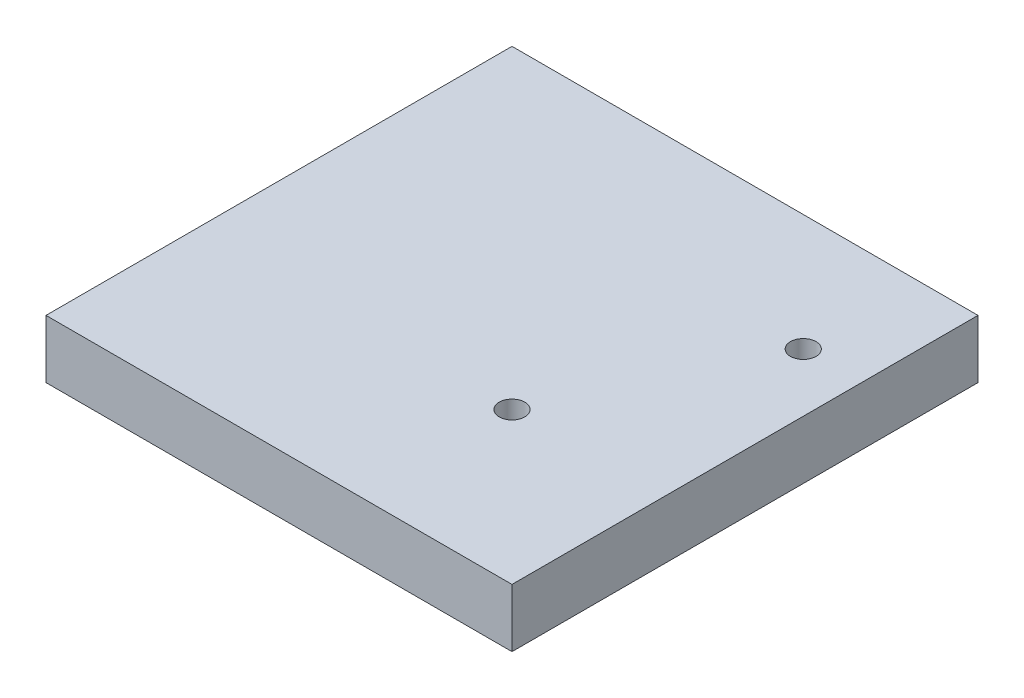
ISO-10303-21;
HEADER;
FILE_DESCRIPTION(('STEP AP214'),'2;1');
FILE_NAME('part.step','',(''),(''),'','','');
FILE_SCHEMA(('AUTOMOTIVE_DESIGN { 1 0 10303 214 1 1 1 1 }'));
ENDSEC;
DATA;
#1=APPLICATION_CONTEXT('core data for automotive mechanical design processes');
#2=APPLICATION_PROTOCOL_DEFINITION('international standard','automotive_design',2000,#1);
#3=PRODUCT_CONTEXT('',#1,'mechanical');
#4=PRODUCT('Part','Part','',(#3));
#5=PRODUCT_RELATED_PRODUCT_CATEGORY('part','',(#4));
#6=PRODUCT_DEFINITION_FORMATION('','',#4);
#7=PRODUCT_DEFINITION_CONTEXT('part definition',#1,'design');
#8=PRODUCT_DEFINITION('design','',#6,#7);
#9=PRODUCT_DEFINITION_SHAPE('','',#8);
#10=(LENGTH_UNIT() NAMED_UNIT(*) SI_UNIT(.MILLI.,.METRE.));
#11=(NAMED_UNIT(*) PLANE_ANGLE_UNIT() SI_UNIT($,.RADIAN.));
#12=(NAMED_UNIT(*) SI_UNIT($,.STERADIAN.) SOLID_ANGLE_UNIT());
#13=UNCERTAINTY_MEASURE_WITH_UNIT(LENGTH_MEASURE(1.E-05),#10,'distance_accuracy_value','');
#14=(GEOMETRIC_REPRESENTATION_CONTEXT(3) GLOBAL_UNCERTAINTY_ASSIGNED_CONTEXT((#13)) GLOBAL_UNIT_ASSIGNED_CONTEXT((#10,
#11,#12)) REPRESENTATION_CONTEXT('',''));
#15=CARTESIAN_POINT('',(0.,0.,0.));
#16=DIRECTION('',(0.,0.,1.));
#17=DIRECTION('',(1.,0.,0.));
#18=AXIS2_PLACEMENT_3D('',#15,#16,#17);
#19=CARTESIAN_POINT('',(0.,5.,0.));
#20=DIRECTION('',(0.,-1.,0.));
#21=DIRECTION('',(0.,0.,-1.));
#22=AXIS2_PLACEMENT_3D('',#19,#20,#21);
#23=PLANE('',#22);
#24=DIRECTION('',(0.,0.,1.));
#25=VECTOR('',#24,1.);
#26=CARTESIAN_POINT('',(0.,5.,0.));
#27=LINE('',#26,#25);
#28=CARTESIAN_POINT('',(0.,5.,-40.));
#29=VERTEX_POINT('',#28);
#30=CARTESIAN_POINT('',(0.,5.,0.));
#31=VERTEX_POINT('',#30);
#32=EDGE_CURVE('E87',#29,#31,#27,.T.);
#33=ORIENTED_EDGE('',*,*,#32,.T.);
#34=DIRECTION('',(1.,0.,0.));
#35=VECTOR('',#34,1.);
#36=CARTESIAN_POINT('',(0.,5.,0.));
#37=LINE('',#36,#35);
#38=CARTESIAN_POINT('',(40.,5.,0.));
#39=VERTEX_POINT('',#38);
#40=EDGE_CURVE('E82',#31,#39,#37,.T.);
#41=ORIENTED_EDGE('',*,*,#40,.T.);
#42=DIRECTION('',(0.,0.,-1.));
#43=VECTOR('',#42,1.);
#44=CARTESIAN_POINT('',(40.,5.,0.));
#45=LINE('',#44,#43);
#46=CARTESIAN_POINT('',(40.,5.,-40.));
#47=VERTEX_POINT('',#46);
#48=EDGE_CURVE('E85',#39,#47,#45,.T.);
#49=ORIENTED_EDGE('',*,*,#48,.T.);
#50=DIRECTION('',(-1.,0.,0.));
#51=VECTOR('',#50,1.);
#52=CARTESIAN_POINT('',(0.,5.,-40.));
#53=LINE('',#52,#51);
#54=EDGE_CURVE('E52',#47,#29,#53,.T.);
#55=ORIENTED_EDGE('',*,*,#54,.T.);
#56=EDGE_LOOP('',(#33,#41,#49,#55));
#57=FACE_BOUND('',#56,.T.);
#58=CARTESIAN_POINT('',(27.,5.,-13.));
#59=DIRECTION('',(0.,1.,0.));
#60=DIRECTION('',(0.,0.,1.));
#61=AXIS2_PLACEMENT_3D('',#58,#59,#60);
#62=CIRCLE('',#61,1.1);
#63=CARTESIAN_POINT('',(27.,5.,-11.9));
#64=VERTEX_POINT('',#63);
#65=EDGE_CURVE('E102',#64,#64,#62,.T.);
#66=ORIENTED_EDGE('',*,*,#65,.F.);
#67=EDGE_LOOP('',(#66));
#68=FACE_BOUND('',#67,.T.);
#69=CARTESIAN_POINT('',(35.,5.,-30.));
#70=DIRECTION('',(0.,1.,0.));
#71=DIRECTION('',(0.,0.,1.));
#72=AXIS2_PLACEMENT_3D('',#69,#70,#71);
#73=CIRCLE('',#72,1.1);
#74=CARTESIAN_POINT('',(35.,5.,-28.9));
#75=VERTEX_POINT('',#74);
#76=EDGE_CURVE('E117',#75,#75,#73,.T.);
#77=ORIENTED_EDGE('',*,*,#76,.F.);
#78=EDGE_LOOP('',(#77));
#79=FACE_BOUND('',#78,.T.);
#80=ADVANCED_FACE('F35',(#57,#68,#79),#23,.F.);
#81=CARTESIAN_POINT('',(0.,0.,0.));
#82=DIRECTION('',(0.,-1.,0.));
#83=DIRECTION('',(0.,0.,-1.));
#84=AXIS2_PLACEMENT_3D('',#81,#82,#83);
#85=PLANE('',#84);
#86=CARTESIAN_POINT('',(27.,0.,-13.));
#87=DIRECTION('',(0.,1.,0.));
#88=DIRECTION('',(0.,0.,1.));
#89=AXIS2_PLACEMENT_3D('',#86,#87,#88);
#90=CIRCLE('',#89,1.1);
#91=CARTESIAN_POINT('',(27.,0.,-11.9));
#92=VERTEX_POINT('',#91);
#93=EDGE_CURVE('E114',#92,#92,#90,.T.);
#94=ORIENTED_EDGE('',*,*,#93,.T.);
#95=EDGE_LOOP('',(#94));
#96=FACE_BOUND('',#95,.T.);
#97=DIRECTION('',(0.,0.,1.));
#98=VECTOR('',#97,1.);
#99=CARTESIAN_POINT('',(0.,0.,0.));
#100=LINE('',#99,#98);
#101=CARTESIAN_POINT('',(0.,0.,-40.));
#102=VERTEX_POINT('',#101);
#103=CARTESIAN_POINT('',(0.,0.,0.));
#104=VERTEX_POINT('',#103);
#105=EDGE_CURVE('E99',#102,#104,#100,.T.);
#106=ORIENTED_EDGE('',*,*,#105,.F.);
#107=DIRECTION('',(-1.,0.,0.));
#108=VECTOR('',#107,1.);
#109=CARTESIAN_POINT('',(0.,0.,-40.));
#110=LINE('',#109,#108);
#111=CARTESIAN_POINT('',(40.,0.,-40.));
#112=VERTEX_POINT('',#111);
#113=EDGE_CURVE('E75',#112,#102,#110,.T.);
#114=ORIENTED_EDGE('',*,*,#113,.F.);
#115=DIRECTION('',(0.,0.,-1.));
#116=VECTOR('',#115,1.);
#117=CARTESIAN_POINT('',(40.,0.,0.));
#118=LINE('',#117,#116);
#119=CARTESIAN_POINT('',(40.,0.,0.));
#120=VERTEX_POINT('',#119);
#121=EDGE_CURVE('E69',#120,#112,#118,.T.);
#122=ORIENTED_EDGE('',*,*,#121,.F.);
#123=DIRECTION('',(1.,0.,0.));
#124=VECTOR('',#123,1.);
#125=CARTESIAN_POINT('',(0.,0.,0.));
#126=LINE('',#125,#124);
#127=EDGE_CURVE('E91',#104,#120,#126,.T.);
#128=ORIENTED_EDGE('',*,*,#127,.F.);
#129=EDGE_LOOP('',(#106,#114,#122,#128));
#130=FACE_BOUND('',#129,.T.);
#131=CARTESIAN_POINT('',(35.,0.,-30.));
#132=DIRECTION('',(0.,1.,0.));
#133=DIRECTION('',(0.,0.,1.));
#134=AXIS2_PLACEMENT_3D('',#131,#132,#133);
#135=CIRCLE('',#134,1.1);
#136=CARTESIAN_POINT('',(35.,0.,-28.9));
#137=VERTEX_POINT('',#136);
#138=EDGE_CURVE('E120',#137,#137,#135,.T.);
#139=ORIENTED_EDGE('',*,*,#138,.T.);
#140=EDGE_LOOP('',(#139));
#141=FACE_BOUND('',#140,.T.);
#142=ADVANCED_FACE('F110',(#96,#130,#141),#85,.T.);
#143=CARTESIAN_POINT('',(0.,5.,0.));
#144=DIRECTION('',(1.,0.,0.));
#145=DIRECTION('',(0.,0.,-1.));
#146=AXIS2_PLACEMENT_3D('',#143,#144,#145);
#147=PLANE('',#146);
#148=ORIENTED_EDGE('',*,*,#105,.T.);
#149=DIRECTION('',(0.,-1.,0.));
#150=VECTOR('',#149,1.);
#151=CARTESIAN_POINT('',(0.,5.,0.));
#152=LINE('',#151,#150);
#153=EDGE_CURVE('E11',#31,#104,#152,.T.);
#154=ORIENTED_EDGE('',*,*,#153,.F.);
#155=ORIENTED_EDGE('',*,*,#32,.F.);
#156=DIRECTION('',(0.,-1.,0.));
#157=VECTOR('',#156,1.);
#158=CARTESIAN_POINT('',(0.,5.,-40.));
#159=LINE('',#158,#157);
#160=EDGE_CURVE('E95',#29,#102,#159,.T.);
#161=ORIENTED_EDGE('',*,*,#160,.T.);
#162=EDGE_LOOP('',(#148,#154,#155,#161));
#163=FACE_BOUND('',#162,.T.);
#164=ADVANCED_FACE('F37',(#163),#147,.F.);
#165=CARTESIAN_POINT('',(0.,5.,0.));
#166=DIRECTION('',(0.,0.,-1.));
#167=DIRECTION('',(-1.,0.,0.));
#168=AXIS2_PLACEMENT_3D('',#165,#166,#167);
#169=PLANE('',#168);
#170=ORIENTED_EDGE('',*,*,#127,.T.);
#171=DIRECTION('',(0.,-1.,0.));
#172=VECTOR('',#171,1.);
#173=CARTESIAN_POINT('',(40.,5.,0.));
#174=LINE('',#173,#172);
#175=EDGE_CURVE('E44',#39,#120,#174,.T.);
#176=ORIENTED_EDGE('',*,*,#175,.F.);
#177=ORIENTED_EDGE('',*,*,#40,.F.);
#178=ORIENTED_EDGE('',*,*,#153,.T.);
#179=EDGE_LOOP('',(#170,#176,#177,#178));
#180=FACE_BOUND('',#179,.T.);
#181=ADVANCED_FACE('F90',(#180),#169,.F.);
#182=CARTESIAN_POINT('',(40.,5.,0.));
#183=DIRECTION('',(-1.,0.,0.));
#184=DIRECTION('',(0.,0.,1.));
#185=AXIS2_PLACEMENT_3D('',#182,#183,#184);
#186=PLANE('',#185);
#187=ORIENTED_EDGE('',*,*,#121,.T.);
#188=DIRECTION('',(0.,-1.,0.));
#189=VECTOR('',#188,1.);
#190=CARTESIAN_POINT('',(40.,5.,-40.));
#191=LINE('',#190,#189);
#192=EDGE_CURVE('E92',#47,#112,#191,.T.);
#193=ORIENTED_EDGE('',*,*,#192,.F.);
#194=ORIENTED_EDGE('',*,*,#48,.F.);
#195=ORIENTED_EDGE('',*,*,#175,.T.);
#196=EDGE_LOOP('',(#187,#193,#194,#195));
#197=FACE_BOUND('',#196,.T.);
#198=ADVANCED_FACE('F93',(#197),#186,.F.);
#199=CARTESIAN_POINT('',(0.,5.,-40.));
#200=DIRECTION('',(0.,0.,1.));
#201=DIRECTION('',(1.,0.,0.));
#202=AXIS2_PLACEMENT_3D('',#199,#200,#201);
#203=PLANE('',#202);
#204=ORIENTED_EDGE('',*,*,#113,.T.);
#205=ORIENTED_EDGE('',*,*,#160,.F.);
#206=ORIENTED_EDGE('',*,*,#54,.F.);
#207=ORIENTED_EDGE('',*,*,#192,.T.);
#208=EDGE_LOOP('',(#204,#205,#206,#207));
#209=FACE_BOUND('',#208,.T.);
#210=ADVANCED_FACE('F107',(#209),#203,.F.);
#211=CARTESIAN_POINT('',(27.,5.,-13.));
#212=DIRECTION('',(0.,-1.,0.));
#213=DIRECTION('',(0.,0.,-1.));
#214=AXIS2_PLACEMENT_3D('',#211,#212,#213);
#215=CYLINDRICAL_SURFACE('',#214,1.1);
#216=ORIENTED_EDGE('',*,*,#65,.T.);
#217=EDGE_LOOP('',(#216));
#218=FACE_BOUND('',#217,.T.);
#219=ORIENTED_EDGE('',*,*,#93,.F.);
#220=EDGE_LOOP('',(#219));
#221=FACE_BOUND('',#220,.T.);
#222=ADVANCED_FACE('F137',(#218,#221),#215,.F.);
#223=CARTESIAN_POINT('',(35.,5.,-30.));
#224=DIRECTION('',(0.,-1.,0.));
#225=DIRECTION('',(0.,0.,-1.));
#226=AXIS2_PLACEMENT_3D('',#223,#224,#225);
#227=CYLINDRICAL_SURFACE('',#226,1.1);
#228=ORIENTED_EDGE('',*,*,#76,.T.);
#229=EDGE_LOOP('',(#228));
#230=FACE_BOUND('',#229,.T.);
#231=ORIENTED_EDGE('',*,*,#138,.F.);
#232=EDGE_LOOP('',(#231));
#233=FACE_BOUND('',#232,.T.);
#234=ADVANCED_FACE('F126',(#230,#233),#227,.F.);
#235=CLOSED_SHELL('',(#80,#142,#164,#181,#198,#210,#222,#234));
#236=MANIFOLD_SOLID_BREP('B2',#235);
#237=ADVANCED_BREP_SHAPE_REPRESENTATION('',(#18,#236),#14);
#238=SHAPE_DEFINITION_REPRESENTATION(#9,#237);
ENDSEC;
END-ISO-10303-21;
